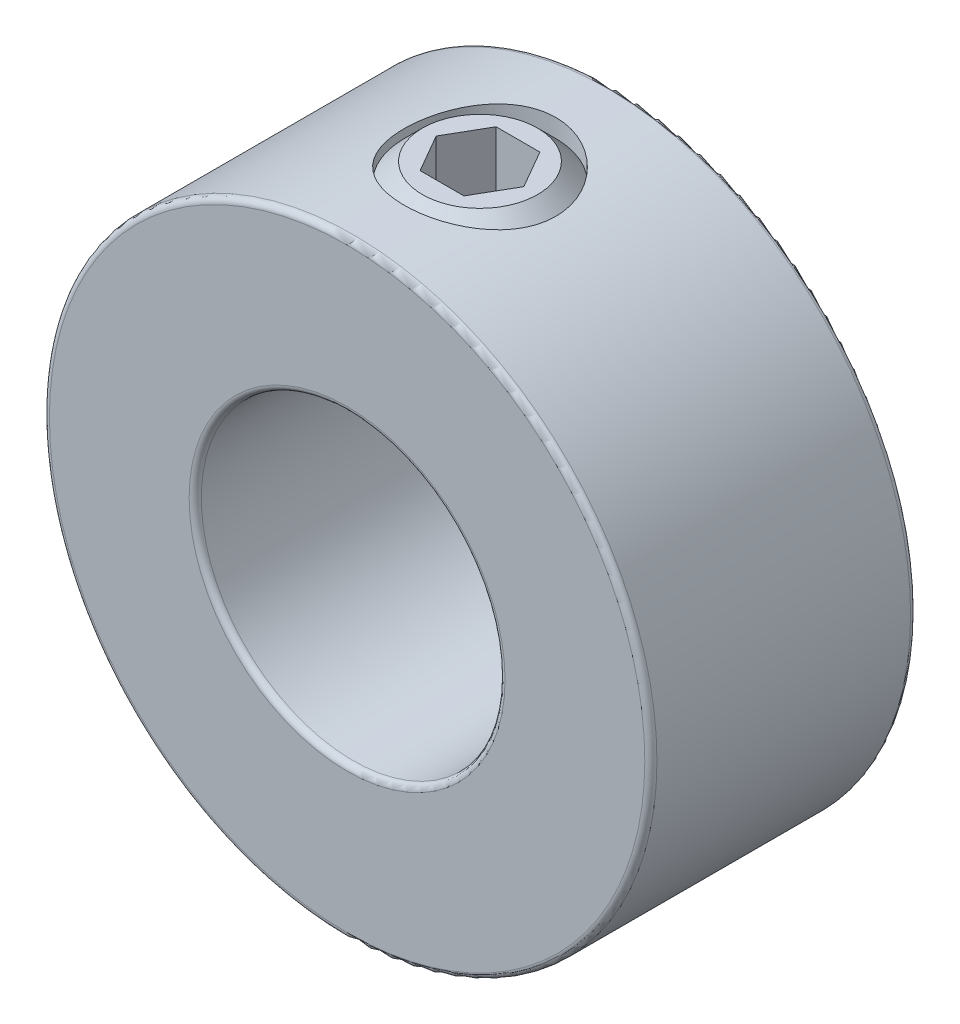
ISO-10303-21;
HEADER;
FILE_DESCRIPTION(('STEP AP214'),'2;1');
FILE_NAME('part.step','',(''),(''),'','','');
FILE_SCHEMA(('AUTOMOTIVE_DESIGN { 1 0 10303 214 1 1 1 1 }'));
ENDSEC;
DATA;
#1=APPLICATION_CONTEXT('core data for automotive mechanical design processes');
#2=APPLICATION_PROTOCOL_DEFINITION('international standard','automotive_design',2000,#1);
#3=PRODUCT_CONTEXT('',#1,'mechanical');
#4=PRODUCT('Part','Part','',(#3));
#5=PRODUCT_RELATED_PRODUCT_CATEGORY('part','',(#4));
#6=PRODUCT_DEFINITION_FORMATION('','',#4);
#7=PRODUCT_DEFINITION_CONTEXT('part definition',#1,'design');
#8=PRODUCT_DEFINITION('design','',#6,#7);
#9=PRODUCT_DEFINITION_SHAPE('','',#8);
#10=(LENGTH_UNIT() NAMED_UNIT(*) SI_UNIT(.MILLI.,.METRE.));
#11=(NAMED_UNIT(*) PLANE_ANGLE_UNIT() SI_UNIT($,.RADIAN.));
#12=(NAMED_UNIT(*) SI_UNIT($,.STERADIAN.) SOLID_ANGLE_UNIT());
#13=UNCERTAINTY_MEASURE_WITH_UNIT(LENGTH_MEASURE(1.E-05),#10,'distance_accuracy_value','');
#14=(GEOMETRIC_REPRESENTATION_CONTEXT(3) GLOBAL_UNCERTAINTY_ASSIGNED_CONTEXT((#13)) GLOBAL_UNIT_ASSIGNED_CONTEXT((#10,
#11,#12)) REPRESENTATION_CONTEXT('',''));
#15=CARTESIAN_POINT('',(0.,0.,0.));
#16=DIRECTION('',(0.,0.,1.));
#17=DIRECTION('',(1.,0.,0.));
#18=AXIS2_PLACEMENT_3D('',#15,#16,#17);
#19=CARTESIAN_POINT('',(0.,12.7,0.));
#20=DIRECTION('',(0.,1.,0.));
#21=DIRECTION('',(-1.,0.,0.));
#22=AXIS2_PLACEMENT_3D('',#19,#20,#21);
#23=PLANE('',#22);
#24=CARTESIAN_POINT('',(0.,12.7,0.));
#25=DIRECTION('',(0.,1.,0.));
#26=DIRECTION('',(-1.,0.,0.));
#27=AXIS2_PLACEMENT_3D('',#24,#25,#26);
#28=CIRCLE('',#27,2.40819263124403);
#29=CARTESIAN_POINT('',(-2.40819263124403,12.7,0.));
#30=VERTEX_POINT('',#29);
#31=EDGE_CURVE('E116',#30,#30,#28,.T.);
#32=ORIENTED_EDGE('',*,*,#31,.T.);
#33=EDGE_LOOP('',(#32));
#34=FACE_BOUND('',#33,.T.);
#35=DIRECTION('',(1.,0.,0.));
#36=VECTOR('',#35,1.);
#37=CARTESIAN_POINT('',(-0.916543552338531,12.7,-1.5875));
#38=LINE('',#37,#36);
#39=CARTESIAN_POINT('',(-0.916543552338531,12.7,-1.5875));
#40=VERTEX_POINT('',#39);
#41=CARTESIAN_POINT('',(0.91654355233853,12.7,-1.5875));
#42=VERTEX_POINT('',#41);
#43=EDGE_CURVE('E111',#40,#42,#38,.T.);
#44=ORIENTED_EDGE('',*,*,#43,.T.);
#45=DIRECTION('',(0.5,0.,0.866025403784439));
#46=VECTOR('',#45,1.);
#47=CARTESIAN_POINT('',(0.91654355233853,12.7,-1.5875));
#48=LINE('',#47,#46);
#49=CARTESIAN_POINT('',(1.83308710467706,12.7,0.));
#50=VERTEX_POINT('',#49);
#51=EDGE_CURVE('E57',#42,#50,#48,.T.);
#52=ORIENTED_EDGE('',*,*,#51,.T.);
#53=DIRECTION('',(-0.5,0.,0.866025403784439));
#54=VECTOR('',#53,1.);
#55=CARTESIAN_POINT('',(1.83308710467706,12.7,0.));
#56=LINE('',#55,#54);
#57=CARTESIAN_POINT('',(0.916543552338532,12.7,1.5875));
#58=VERTEX_POINT('',#57);
#59=EDGE_CURVE('E115',#50,#58,#56,.T.);
#60=ORIENTED_EDGE('',*,*,#59,.T.);
#61=DIRECTION('',(-1.,0.,0.));
#62=VECTOR('',#61,1.);
#63=CARTESIAN_POINT('',(0.916543552338532,12.7,1.5875));
#64=LINE('',#63,#62);
#65=CARTESIAN_POINT('',(-0.916543552338531,12.7,1.5875));
#66=VERTEX_POINT('',#65);
#67=EDGE_CURVE('E273',#58,#66,#64,.T.);
#68=ORIENTED_EDGE('',*,*,#67,.T.);
#69=DIRECTION('',(-0.5,0.,-0.866025403784438));
#70=VECTOR('',#69,1.);
#71=CARTESIAN_POINT('',(-0.916543552338531,12.7,1.5875));
#72=LINE('',#71,#70);
#73=CARTESIAN_POINT('',(-1.83308710467706,12.7,0.));
#74=VERTEX_POINT('',#73);
#75=EDGE_CURVE('E270',#66,#74,#72,.T.);
#76=ORIENTED_EDGE('',*,*,#75,.T.);
#77=DIRECTION('',(0.5,0.,-0.866025403784438));
#78=VECTOR('',#77,1.);
#79=CARTESIAN_POINT('',(-1.83308710467706,12.7,0.));
#80=LINE('',#79,#78);
#81=EDGE_CURVE('E264',#74,#40,#80,.T.);
#82=ORIENTED_EDGE('',*,*,#81,.T.);
#83=EDGE_LOOP('',(#44,#52,#60,#68,#76,#82));
#84=FACE_BOUND('',#83,.T.);
#85=ADVANCED_FACE('F42',(#34,#84),#23,.T.);
#86=CARTESIAN_POINT('',(0.,6.35,0.));
#87=DIRECTION('',(0.,-1.,0.));
#88=DIRECTION('',(1.,0.,0.));
#89=AXIS2_PLACEMENT_3D('',#86,#87,#88);
#90=CONICAL_SURFACE('',#89,0.920168842507158,0.785398163397448);
#91=CARTESIAN_POINT('',(0.,7.27016884250716,0.));
#92=VERTEX_POINT('',#91);
#93=VERTEX_LOOP('',#92);
#94=FACE_BOUND('',#93,.T.);
#95=CARTESIAN_POINT('',(0.,6.35,0.));
#96=DIRECTION('',(0.,1.,0.));
#97=DIRECTION('',(-1.,0.,0.));
#98=AXIS2_PLACEMENT_3D('',#95,#96,#97);
#99=CIRCLE('',#98,0.920168842507158);
#100=CARTESIAN_POINT('',(-0.920168842507158,6.35,0.));
#101=VERTEX_POINT('',#100);
#102=EDGE_CURVE('E12',#101,#101,#99,.T.);
#103=ORIENTED_EDGE('',*,*,#102,.F.);
#104=EDGE_LOOP('',(#103));
#105=FACE_BOUND('',#104,.T.);
#106=ADVANCED_FACE('F44',(#94,#105),#90,.F.);
#107=CARTESIAN_POINT('',(-2.40819263124403,6.35,0.));
#108=DIRECTION('',(0.,-1.,0.));
#109=DIRECTION('',(1.,0.,0.));
#110=AXIS2_PLACEMENT_3D('',#107,#108,#109);
#111=PLANE('',#110);
#112=ORIENTED_EDGE('',*,*,#102,.T.);
#113=EDGE_LOOP('',(#112));
#114=FACE_BOUND('',#113,.T.);
#115=CARTESIAN_POINT('',(0.,6.35,0.));
#116=DIRECTION('',(0.,1.,0.));
#117=DIRECTION('',(-1.,0.,0.));
#118=AXIS2_PLACEMENT_3D('',#115,#116,#117);
#119=CIRCLE('',#118,2.40819263124403);
#120=CARTESIAN_POINT('',(-2.40819263124403,6.35,0.));
#121=VERTEX_POINT('',#120);
#122=EDGE_CURVE('E50',#121,#121,#119,.T.);
#123=ORIENTED_EDGE('',*,*,#122,.F.);
#124=EDGE_LOOP('',(#123));
#125=FACE_BOUND('',#124,.T.);
#126=ADVANCED_FACE('F136',(#114,#125),#111,.T.);
#127=CARTESIAN_POINT('',(0.,7.11680736875596,0.));
#128=DIRECTION('',(0.,1.,0.));
#129=DIRECTION('',(-1.,0.,0.));
#130=AXIS2_PLACEMENT_3D('',#127,#128,#129);
#131=CONICAL_SURFACE('',#130,3.175,0.785398163397448);
#132=ORIENTED_EDGE('',*,*,#122,.T.);
#133=EDGE_LOOP('',(#132));
#134=FACE_BOUND('',#133,.T.);
#135=CARTESIAN_POINT('',(0.,7.11680736875596,0.));
#136=DIRECTION('',(0.,1.,0.));
#137=DIRECTION('',(-1.,0.,0.));
#138=AXIS2_PLACEMENT_3D('',#135,#136,#137);
#139=CIRCLE('',#138,3.175);
#140=CARTESIAN_POINT('',(-3.175,7.11680736875596,0.));
#141=VERTEX_POINT('',#140);
#142=EDGE_CURVE('E128',#141,#141,#139,.T.);
#143=ORIENTED_EDGE('',*,*,#142,.F.);
#144=EDGE_LOOP('',(#143));
#145=FACE_BOUND('',#144,.T.);
#146=ADVANCED_FACE('F133',(#134,#145),#131,.T.);
#147=CARTESIAN_POINT('',(0.,6.35,0.));
#148=DIRECTION('',(0.,1.,0.));
#149=DIRECTION('',(-1.,0.,0.));
#150=AXIS2_PLACEMENT_3D('',#147,#148,#149);
#151=CYLINDRICAL_SURFACE('',#150,3.175);
#152=ORIENTED_EDGE('',*,*,#142,.T.);
#153=EDGE_LOOP('',(#152));
#154=FACE_BOUND('',#153,.T.);
#155=CARTESIAN_POINT('',(0.,11.933192631244,0.));
#156=DIRECTION('',(0.,1.,0.));
#157=DIRECTION('',(-1.,0.,0.));
#158=AXIS2_PLACEMENT_3D('',#155,#156,#157);
#159=CIRCLE('',#158,3.175);
#160=CARTESIAN_POINT('',(-3.175,11.933192631244,0.));
#161=VERTEX_POINT('',#160);
#162=EDGE_CURVE('E120',#161,#161,#159,.T.);
#163=ORIENTED_EDGE('',*,*,#162,.F.);
#164=EDGE_LOOP('',(#163));
#165=FACE_BOUND('',#164,.T.);
#166=ADVANCED_FACE('F143',(#154,#165),#151,.T.);
#167=CARTESIAN_POINT('',(0.,12.7,0.));
#168=DIRECTION('',(0.,-1.,0.));
#169=DIRECTION('',(1.,0.,0.));
#170=AXIS2_PLACEMENT_3D('',#167,#168,#169);
#171=CONICAL_SURFACE('',#170,2.40819263124403,0.785398163397448);
#172=ORIENTED_EDGE('',*,*,#162,.T.);
#173=EDGE_LOOP('',(#172));
#174=FACE_BOUND('',#173,.T.);
#175=ORIENTED_EDGE('',*,*,#31,.F.);
#176=EDGE_LOOP('',(#175));
#177=FACE_BOUND('',#176,.T.);
#178=ADVANCED_FACE('F154',(#174,#177),#171,.T.);
#179=CARTESIAN_POINT('',(0.91654355233853,9.52499999999999,-1.5875));
#180=DIRECTION('',(-0.866025403784439,0.,0.5));
#181=DIRECTION('',(0.5,0.,0.866025403784439));
#182=AXIS2_PLACEMENT_3D('',#179,#180,#181);
#183=PLANE('',#182);
#184=ORIENTED_EDGE('',*,*,#51,.F.);
#185=DIRECTION('',(0.,1.,0.));
#186=VECTOR('',#185,1.);
#187=CARTESIAN_POINT('',(0.91654355233853,9.52499999999999,-1.5875));
#188=LINE('',#187,#186);
#189=CARTESIAN_POINT('',(0.91654355233853,9.52499999999999,-1.5875));
#190=VERTEX_POINT('',#189);
#191=EDGE_CURVE('E110',#190,#42,#188,.T.);
#192=ORIENTED_EDGE('',*,*,#191,.F.);
#193=DIRECTION('',(0.5,0.,0.866025403784439));
#194=VECTOR('',#193,1.);
#195=CARTESIAN_POINT('',(0.91654355233853,9.52499999999999,-1.5875));
#196=LINE('',#195,#194);
#197=CARTESIAN_POINT('',(1.83308710467706,9.52499999999999,0.));
#198=VERTEX_POINT('',#197);
#199=EDGE_CURVE('E101',#190,#198,#196,.T.);
#200=ORIENTED_EDGE('',*,*,#199,.T.);
#201=DIRECTION('',(0.,1.,0.));
#202=VECTOR('',#201,1.);
#203=CARTESIAN_POINT('',(1.83308710467706,9.52499999999999,0.));
#204=LINE('',#203,#202);
#205=EDGE_CURVE('E109',#198,#50,#204,.T.);
#206=ORIENTED_EDGE('',*,*,#205,.T.);
#207=EDGE_LOOP('',(#184,#192,#200,#206));
#208=FACE_BOUND('',#207,.T.);
#209=ADVANCED_FACE('F108',(#208),#183,.T.);
#210=CARTESIAN_POINT('',(1.83308710467706,9.52499999999999,0.));
#211=DIRECTION('',(-0.866025403784439,0.,-0.5));
#212=DIRECTION('',(-0.5,0.,0.866025403784439));
#213=AXIS2_PLACEMENT_3D('',#210,#211,#212);
#214=PLANE('',#213);
#215=ORIENTED_EDGE('',*,*,#59,.F.);
#216=ORIENTED_EDGE('',*,*,#205,.F.);
#217=DIRECTION('',(-0.5,0.,0.866025403784439));
#218=VECTOR('',#217,1.);
#219=CARTESIAN_POINT('',(1.83308710467706,9.52499999999999,0.));
#220=LINE('',#219,#218);
#221=CARTESIAN_POINT('',(0.916543552338532,9.52499999999999,1.5875));
#222=VERTEX_POINT('',#221);
#223=EDGE_CURVE('E97',#198,#222,#220,.T.);
#224=ORIENTED_EDGE('',*,*,#223,.T.);
#225=DIRECTION('',(0.,1.,0.));
#226=VECTOR('',#225,1.);
#227=CARTESIAN_POINT('',(0.916543552338532,9.52499999999999,1.5875));
#228=LINE('',#227,#226);
#229=EDGE_CURVE('E117',#222,#58,#228,.T.);
#230=ORIENTED_EDGE('',*,*,#229,.T.);
#231=EDGE_LOOP('',(#215,#216,#224,#230));
#232=FACE_BOUND('',#231,.T.);
#233=ADVANCED_FACE('F113',(#232),#214,.T.);
#234=CARTESIAN_POINT('',(0.916543552338532,9.52499999999999,1.5875));
#235=DIRECTION('',(0.,0.,-1.));
#236=DIRECTION('',(-1.,0.,0.));
#237=AXIS2_PLACEMENT_3D('',#234,#235,#236);
#238=PLANE('',#237);
#239=ORIENTED_EDGE('',*,*,#67,.F.);
#240=ORIENTED_EDGE('',*,*,#229,.F.);
#241=DIRECTION('',(-1.,0.,0.));
#242=VECTOR('',#241,1.);
#243=CARTESIAN_POINT('',(0.916543552338532,9.52499999999999,1.5875));
#244=LINE('',#243,#242);
#245=CARTESIAN_POINT('',(-0.916543552338531,9.52499999999999,1.5875));
#246=VERTEX_POINT('',#245);
#247=EDGE_CURVE('E103',#222,#246,#244,.T.);
#248=ORIENTED_EDGE('',*,*,#247,.T.);
#249=DIRECTION('',(0.,1.,0.));
#250=VECTOR('',#249,1.);
#251=CARTESIAN_POINT('',(-0.916543552338531,9.52499999999999,1.5875));
#252=LINE('',#251,#250);
#253=EDGE_CURVE('E122',#246,#66,#252,.T.);
#254=ORIENTED_EDGE('',*,*,#253,.T.);
#255=EDGE_LOOP('',(#239,#240,#248,#254));
#256=FACE_BOUND('',#255,.T.);
#257=ADVANCED_FACE('F184',(#256),#238,.T.);
#258=CARTESIAN_POINT('',(-0.916543552338531,9.52499999999999,1.5875));
#259=DIRECTION('',(0.866025403784439,0.,-0.5));
#260=DIRECTION('',(-0.5,0.,-0.866025403784439));
#261=AXIS2_PLACEMENT_3D('',#258,#259,#260);
#262=PLANE('',#261);
#263=ORIENTED_EDGE('',*,*,#75,.F.);
#264=ORIENTED_EDGE('',*,*,#253,.F.);
#265=DIRECTION('',(-0.5,0.,-0.866025403784438));
#266=VECTOR('',#265,1.);
#267=CARTESIAN_POINT('',(-0.916543552338531,9.52499999999999,1.5875));
#268=LINE('',#267,#266);
#269=CARTESIAN_POINT('',(-1.83308710467706,9.52499999999999,0.));
#270=VERTEX_POINT('',#269);
#271=EDGE_CURVE('E289',#246,#270,#268,.T.);
#272=ORIENTED_EDGE('',*,*,#271,.T.);
#273=DIRECTION('',(0.,1.,0.));
#274=VECTOR('',#273,1.);
#275=CARTESIAN_POINT('',(-1.83308710467706,9.52499999999999,0.));
#276=LINE('',#275,#274);
#277=EDGE_CURVE('E280',#270,#74,#276,.T.);
#278=ORIENTED_EDGE('',*,*,#277,.T.);
#279=EDGE_LOOP('',(#263,#264,#272,#278));
#280=FACE_BOUND('',#279,.T.);
#281=ADVANCED_FACE('F190',(#280),#262,.T.);
#282=CARTESIAN_POINT('',(-1.83308710467706,9.52499999999999,0.));
#283=DIRECTION('',(0.866025403784439,0.,0.5));
#284=DIRECTION('',(0.5,0.,-0.866025403784439));
#285=AXIS2_PLACEMENT_3D('',#282,#283,#284);
#286=PLANE('',#285);
#287=ORIENTED_EDGE('',*,*,#81,.F.);
#288=ORIENTED_EDGE('',*,*,#277,.F.);
#289=DIRECTION('',(0.5,0.,-0.866025403784438));
#290=VECTOR('',#289,1.);
#291=CARTESIAN_POINT('',(-1.83308710467706,9.52499999999999,0.));
#292=LINE('',#291,#290);
#293=CARTESIAN_POINT('',(-0.916543552338531,9.52499999999999,-1.5875));
#294=VERTEX_POINT('',#293);
#295=EDGE_CURVE('E287',#270,#294,#292,.T.);
#296=ORIENTED_EDGE('',*,*,#295,.T.);
#297=DIRECTION('',(0.,1.,0.));
#298=VECTOR('',#297,1.);
#299=CARTESIAN_POINT('',(-0.916543552338531,9.52499999999999,-1.5875));
#300=LINE('',#299,#298);
#301=EDGE_CURVE('E263',#294,#40,#300,.T.);
#302=ORIENTED_EDGE('',*,*,#301,.T.);
#303=EDGE_LOOP('',(#287,#288,#296,#302));
#304=FACE_BOUND('',#303,.T.);
#305=ADVANCED_FACE('F198',(#304),#286,.T.);
#306=CARTESIAN_POINT('',(-0.916543552338531,9.52499999999999,-1.5875));
#307=DIRECTION('',(0.,0.,1.));
#308=DIRECTION('',(1.,0.,0.));
#309=AXIS2_PLACEMENT_3D('',#306,#307,#308);
#310=PLANE('',#309);
#311=ORIENTED_EDGE('',*,*,#43,.F.);
#312=ORIENTED_EDGE('',*,*,#301,.F.);
#313=DIRECTION('',(1.,0.,0.));
#314=VECTOR('',#313,1.);
#315=CARTESIAN_POINT('',(-0.916543552338531,9.52499999999999,-1.5875));
#316=LINE('',#315,#314);
#317=EDGE_CURVE('E278',#294,#190,#316,.T.);
#318=ORIENTED_EDGE('',*,*,#317,.T.);
#319=ORIENTED_EDGE('',*,*,#191,.T.);
#320=EDGE_LOOP('',(#311,#312,#318,#319));
#321=FACE_BOUND('',#320,.T.);
#322=ADVANCED_FACE('F206',(#321),#310,.T.);
#323=CARTESIAN_POINT('',(0.,9.52499999999999,-3.175));
#324=DIRECTION('',(0.,1.,0.));
#325=DIRECTION('',(0.,0.,1.));
#326=AXIS2_PLACEMENT_3D('',#323,#324,#325);
#327=PLANE('',#326);
#328=ORIENTED_EDGE('',*,*,#199,.F.);
#329=ORIENTED_EDGE('',*,*,#317,.F.);
#330=ORIENTED_EDGE('',*,*,#295,.F.);
#331=ORIENTED_EDGE('',*,*,#271,.F.);
#332=ORIENTED_EDGE('',*,*,#247,.F.);
#333=ORIENTED_EDGE('',*,*,#223,.F.);
#334=EDGE_LOOP('',(#328,#329,#330,#331,#332,#333));
#335=FACE_BOUND('',#334,.T.);
#336=ADVANCED_FACE('F99',(#335),#327,.T.);
#337=CLOSED_SHELL('',(#85,#106,#126,#146,#166,#178,#209,#233,#257,#281,#305,#322,#336));
#338=MANIFOLD_SOLID_BREP('B2',#337);
#339=CARTESIAN_POINT('',(0.,0.,5.55625));
#340=DIRECTION('',(0.,0.,1.));
#341=DIRECTION('',(1.,0.,0.));
#342=AXIS2_PLACEMENT_3D('',#339,#340,#341);
#343=PLANE('',#342);
#344=CARTESIAN_POINT('',(0.,0.,5.55625));
#345=DIRECTION('',(0.,0.,1.));
#346=DIRECTION('',(1.,0.,0.));
#347=AXIS2_PLACEMENT_3D('',#344,#345,#346);
#348=CIRCLE('',#347,6.604);
#349=CARTESIAN_POINT('',(6.604,0.,5.55625));
#350=VERTEX_POINT('',#349);
#351=EDGE_CURVE('E307',#350,#350,#348,.F.);
#352=ORIENTED_EDGE('',*,*,#351,.T.);
#353=EDGE_LOOP('',(#352));
#354=FACE_BOUND('',#353,.T.);
#355=CARTESIAN_POINT('',(0.,0.,5.55625));
#356=DIRECTION('',(0.,0.,1.));
#357=DIRECTION('',(1.,0.,0.));
#358=AXIS2_PLACEMENT_3D('',#355,#356,#357);
#359=CIRCLE('',#358,12.446);
#360=CARTESIAN_POINT('',(12.446,0.,5.55625));
#361=VERTEX_POINT('',#360);
#362=EDGE_CURVE('E311',#361,#361,#359,.T.);
#363=ORIENTED_EDGE('',*,*,#362,.T.);
#364=EDGE_LOOP('',(#363));
#365=FACE_BOUND('',#364,.T.);
#366=ADVANCED_FACE('F296',(#354,#365),#343,.T.);
#367=CARTESIAN_POINT('',(0.,0.,-5.55625));
#368=DIRECTION('',(0.,0.,1.));
#369=DIRECTION('',(1.,0.,0.));
#370=AXIS2_PLACEMENT_3D('',#367,#368,#369);
#371=PLANE('',#370);
#372=CARTESIAN_POINT('',(0.,0.,-5.55625));
#373=DIRECTION('',(0.,0.,1.));
#374=DIRECTION('',(1.,0.,0.));
#375=AXIS2_PLACEMENT_3D('',#372,#373,#374);
#376=CIRCLE('',#375,6.604);
#377=CARTESIAN_POINT('',(6.604,0.,-5.55625));
#378=VERTEX_POINT('',#377);
#379=EDGE_CURVE('E322',#378,#378,#376,.T.);
#380=ORIENTED_EDGE('',*,*,#379,.T.);
#381=EDGE_LOOP('',(#380));
#382=FACE_BOUND('',#381,.T.);
#383=CARTESIAN_POINT('',(0.,0.,-5.55625));
#384=DIRECTION('',(0.,0.,1.));
#385=DIRECTION('',(1.,0.,0.));
#386=AXIS2_PLACEMENT_3D('',#383,#384,#385);
#387=CIRCLE('',#386,12.446);
#388=CARTESIAN_POINT('',(12.446,0.,-5.55625));
#389=VERTEX_POINT('',#388);
#390=EDGE_CURVE('E325',#389,#389,#387,.F.);
#391=ORIENTED_EDGE('',*,*,#390,.T.);
#392=EDGE_LOOP('',(#391));
#393=FACE_BOUND('',#392,.T.);
#394=ADVANCED_FACE('F359',(#382,#393),#371,.F.);
#395=CARTESIAN_POINT('',(0.,0.,5.55625));
#396=DIRECTION('',(0.,0.,-1.));
#397=DIRECTION('',(-1.,0.,0.));
#398=AXIS2_PLACEMENT_3D('',#395,#396,#397);
#399=CYLINDRICAL_SURFACE('',#398,12.7);
#400=CARTESIAN_POINT('',(0.,0.,-5.30225));
#401=DIRECTION('',(0.,0.,1.));
#402=DIRECTION('',(1.,0.,0.));
#403=AXIS2_PLACEMENT_3D('',#400,#401,#402);
#404=CIRCLE('',#403,12.7);
#405=CARTESIAN_POINT('',(12.7,0.,-5.30225));
#406=VERTEX_POINT('',#405);
#407=EDGE_CURVE('E41',#406,#406,#404,.T.);
#408=ORIENTED_EDGE('',*,*,#407,.T.);
#409=EDGE_LOOP('',(#408));
#410=FACE_BOUND('',#409,.T.);
#411=CARTESIAN_POINT('',(0.,0.,5.30225));
#412=DIRECTION('',(0.,0.,1.));
#413=DIRECTION('',(1.,0.,0.));
#414=AXIS2_PLACEMENT_3D('',#411,#412,#413);
#415=CIRCLE('',#414,12.7);
#416=CARTESIAN_POINT('',(12.7,0.,5.30225));
#417=VERTEX_POINT('',#416);
#418=EDGE_CURVE('E303',#417,#417,#415,.F.);
#419=ORIENTED_EDGE('',*,*,#418,.T.);
#420=EDGE_LOOP('',(#419));
#421=FACE_BOUND('',#420,.T.);
#422=CARTESIAN_POINT('',(0.,12.7,-3.175));
#423=CARTESIAN_POINT('',(0.175421054350931,12.6999970338729,-3.17499507718756));
#424=CARTESIAN_POINT('',(0.350897100741782,12.6963292371237,-3.16041288419548));
#425=CARTESIAN_POINT('',(0.69682005198096,12.6820530760661,-3.10255676306683));
#426=CARTESIAN_POINT('',(0.867264049209731,12.6714407780562,-3.05926657314488));
#427=CARTESIAN_POINT('',(1.19807751278645,12.6444507573613,-2.94547024683858));
#428=CARTESIAN_POINT('',(1.35845880926017,12.6280799601569,-2.87499679271934));
#429=CARTESIAN_POINT('',(1.6651226791977,12.591316443928,-2.70894939107175));
#430=CARTESIAN_POINT('',(1.81140477687155,12.5709235892463,-2.61337459688152));
#431=CARTESIAN_POINT('',(2.08873074612027,12.5278602543575,-2.39775832856532));
#432=CARTESIAN_POINT('',(2.2194428772959,12.5051546346353,-2.27729716633665));
#433=CARTESIAN_POINT('',(2.45903522924702,12.4602582924963,-2.01622616627587));
#434=CARTESIAN_POINT('',(2.56791298487579,12.4380676284689,-1.87561405642898));
#435=CARTESIAN_POINT('',(2.76230618225783,12.3963594189446,-1.57565677007337));
#436=CARTESIAN_POINT('',(2.84745052370821,12.3768864828385,-1.41606432812152));
#437=CARTESIAN_POINT('',(2.98957345643241,12.343330973648,-1.08426586198626));
#438=CARTESIAN_POINT('',(3.04655655068163,12.3292475388652,-0.912061859447231));
#439=CARTESIAN_POINT('',(3.12960773790342,12.3084267567388,-0.563576262139818));
#440=CARTESIAN_POINT('',(3.15627230130284,12.3015478927701,-0.387445470052915));
#441=CARTESIAN_POINT('',(3.17978742389056,12.2954915053947,-0.0330865289513835));
#442=CARTESIAN_POINT('',(3.176642833515,12.2963127290578,0.145141274131692));
#443=CARTESIAN_POINT('',(3.14110481048737,12.3054365167726,0.494063459727666));
#444=CARTESIAN_POINT('',(3.10942215340351,12.3135572669877,0.664835732101618));
#445=CARTESIAN_POINT('',(3.01884119561133,12.3360753547043,0.998560891095076));
#446=CARTESIAN_POINT('',(2.95994095604688,12.3504731393489,1.16151321974455));
#447=CARTESIAN_POINT('',(2.81599106163371,12.3840899110031,1.47687880106701));
#448=CARTESIAN_POINT('',(2.73068344564301,12.4033560981111,1.62916906362126));
#449=CARTESIAN_POINT('',(2.53652078423164,12.4445122129068,1.91752793565194));
#450=CARTESIAN_POINT('',(2.42766161831204,12.4664025994163,2.05359370007568));
#451=CARTESIAN_POINT('',(2.18580424890858,12.5111061380944,2.30971431988649));
#452=CARTESIAN_POINT('',(2.05220624645107,12.533927803951,2.42920200396319));
#453=CARTESIAN_POINT('',(1.76659522538283,12.5773596047503,2.64418496321526));
#454=CARTESIAN_POINT('',(1.61458164448181,12.5979696721291,2.73967950552455));
#455=CARTESIAN_POINT('',(1.29564529770895,12.6347586626604,2.90417374084162));
#456=CARTESIAN_POINT('',(1.12867311562492,12.6509221227036,2.97308130353854));
#457=CARTESIAN_POINT('',(0.785020883902435,12.676884242985,3.0816916304186));
#458=CARTESIAN_POINT('',(0.608342698201859,12.6866841206814,3.12139998108506));
#459=CARTESIAN_POINT('',(0.255142937325556,12.6986347345774,3.16961851376621));
#460=CARTESIAN_POINT('',(0.078733057308377,12.7009747992585,3.17890107185939));
#461=CARTESIAN_POINT('',(-0.273119584996527,12.6982813685726,3.16812294564922));
#462=CARTESIAN_POINT('',(-0.448562432914396,12.6932485369526,3.14806490274183));
#463=CARTESIAN_POINT('',(-0.790816868910238,12.6764961338622,3.07981157723825));
#464=CARTESIAN_POINT('',(-0.957717835150521,12.6648767569325,3.03203765897374));
#465=CARTESIAN_POINT('',(-1.28112793569116,12.6362609570897,2.91019000547309));
#466=CARTESIAN_POINT('',(-1.43763601861911,12.6192639911647,2.83611361420368));
#467=CARTESIAN_POINT('',(-1.73889063454314,12.5813250177716,2.6622668605486));
#468=CARTESIAN_POINT('',(-1.88337918521903,12.5603183592593,2.56206389542727));
#469=CARTESIAN_POINT('',(-2.15376466554501,12.5167921111412,2.33936135971267));
#470=CARTESIAN_POINT('',(-2.27965837982672,12.4942722608556,2.21685794114268));
#471=CARTESIAN_POINT('',(-2.51246336908675,12.4495762556412,1.94944584954746));
#472=CARTESIAN_POINT('',(-2.6188328531313,12.4274221051899,1.80406102865082));
#473=CARTESIAN_POINT('',(-2.80566443991221,12.3865825924258,1.49704925704163));
#474=CARTESIAN_POINT('',(-2.88612769264178,12.3678970761538,1.335423027713));
#475=CARTESIAN_POINT('',(-3.0182638402854,12.3363163381503,1.00138288757303));
#476=CARTESIAN_POINT('',(-3.07010730622843,12.3233869021911,0.829039853404032));
#477=CARTESIAN_POINT('',(-3.14398164687971,12.3047494152553,0.477711266541238));
#478=CARTESIAN_POINT('',(-3.16601904149253,12.299039785006,0.298727175343936));
#479=CARTESIAN_POINT('',(-3.17931501621074,12.2956087422145,-0.0552895005203962));
#480=CARTESIAN_POINT('',(-3.17143955029538,12.2976625750886,-0.230287904387485));
#481=CARTESIAN_POINT('',(-3.1271152390873,12.3090074061494,-0.576376564376255));
#482=CARTESIAN_POINT('',(-3.09066696801937,12.3182982588945,-0.747466898966899));
#483=CARTESIAN_POINT('',(-2.9907046261569,12.3429450180984,-1.07994123834368));
#484=CARTESIAN_POINT('',(-2.92735297324093,12.3582644892528,-1.24137696275537));
#485=CARTESIAN_POINT('',(-2.7755107337966,12.3932474960913,-1.5514433934137));
#486=CARTESIAN_POINT('',(-2.68701666057215,12.4129116342002,-1.70007231991313));
#487=CARTESIAN_POINT('',(-2.48468673461549,12.4550092586011,-1.98449063138675));
#488=CARTESIAN_POINT('',(-2.37025002816433,12.4775016056118,-2.11984393874715));
#489=CARTESIAN_POINT('',(-2.12045416901821,12.5223699100401,-2.36970791148384));
#490=CARTESIAN_POINT('',(-1.98509005500274,12.5447458385544,-2.48421362040584));
#491=CARTESIAN_POINT('',(-1.6943230585205,12.5873437112106,-2.69115393646168));
#492=CARTESIAN_POINT('',(-1.53860166056969,12.6075193062447,-2.78315126560482));
#493=CARTESIAN_POINT('',(-1.21341315929717,12.6429542453062,-2.93951546322414));
#494=CARTESIAN_POINT('',(-1.04395600927443,12.6582171100619,-3.0039021300394));
#495=CARTESIAN_POINT('',(-0.729001702698682,12.6798505941374,-3.09366037419776));
#496=CARTESIAN_POINT('',(-0.585004695088745,12.6873547169486,-3.12409679779643));
#497=CARTESIAN_POINT('',(-0.294017851418465,12.6974304774096,-3.16476791399977));
#498=CARTESIAN_POINT('',(-0.147028241296871,12.7000024860439,-3.17500412602955));
#499=CARTESIAN_POINT('',(0.,12.7,-3.175));
#500=B_SPLINE_CURVE_WITH_KNOTS('',3,(#422,#423,#424,#425,#426,#427,#428,#429,#430,#431,#432,
#433,#434,#435,#436,#437,#438,#439,#440,#441,#442,#443,#444,#445,#446,#447,#448,#449,#450,#451,
#452,#453,#454,#455,#456,#457,#458,#459,#460,#461,#462,#463,#464,#465,#466,#467,#468,#469,#470,
#471,#472,#473,#474,#475,#476,#477,#478,#479,#480,#481,#482,#483,#484,#485,#486,#487,#488,#489,
#490,#491,#492,#493,#494,#495,#496,#497,#498,#499),.UNSPECIFIED.,.T.,.F.,(4,2,2,2,2,2,2,2,2,2,2,
2,2,2,2,2,2,2,2,2,2,2,2,2,2,2,2,2,2,2,2,2,2,2,2,2,2,2,4),(0.,0.5257243580655,1.05174676993359,
1.57713870983892,2.10254837335841,2.63767221675277,3.17285644277797,3.71599137305291,
4.25903942808496,4.79120824630597,5.3232904734557,5.84247618671883,6.36169889010143,
6.88616284006739,7.41071862276906,7.95023177058119,8.48976139571985,9.0311441807632,
9.57242335981323,10.09985087283,10.6272309069567,11.1467958106174,11.6664131950588,
12.1952509368702,12.7241800170734,13.266092111565,13.8079801469349,14.34660272276,
14.885107458967,15.4081433519175,15.9311687337377,16.4510804786766,16.9710643590661,
17.5046127008447,18.0382877269755,18.5816279265763,19.1245778677202,19.5652441424438,
20.005877269746),.UNSPECIFIED.);
#501=CARTESIAN_POINT('',(0.,12.7,-3.175));
#502=VERTEX_POINT('',#501);
#503=EDGE_CURVE('E328',#502,#502,#500,.T.);
#504=ORIENTED_EDGE('',*,*,#503,.T.);
#505=EDGE_LOOP('',(#504));
#506=FACE_BOUND('',#505,.T.);
#507=ADVANCED_FACE('F355',(#410,#421,#506),#399,.T.);
#508=CARTESIAN_POINT('',(0.,0.,5.55625));
#509=DIRECTION('',(0.,0.,-1.));
#510=DIRECTION('',(-1.,0.,0.));
#511=AXIS2_PLACEMENT_3D('',#508,#509,#510);
#512=CYLINDRICAL_SURFACE('',#511,6.35);
#513=CARTESIAN_POINT('',(0.,0.,-5.30225));
#514=DIRECTION('',(0.,0.,1.));
#515=DIRECTION('',(1.,0.,0.));
#516=AXIS2_PLACEMENT_3D('',#513,#514,#515);
#517=CIRCLE('',#516,6.35);
#518=CARTESIAN_POINT('',(6.35,0.,-5.30225));
#519=VERTEX_POINT('',#518);
#520=EDGE_CURVE('E316',#519,#519,#517,.F.);
#521=ORIENTED_EDGE('',*,*,#520,.T.);
#522=EDGE_LOOP('',(#521));
#523=FACE_BOUND('',#522,.T.);
#524=CARTESIAN_POINT('',(0.,0.,5.30225));
#525=DIRECTION('',(0.,0.,1.));
#526=DIRECTION('',(1.,0.,0.));
#527=AXIS2_PLACEMENT_3D('',#524,#525,#526);
#528=CIRCLE('',#527,6.35);
#529=CARTESIAN_POINT('',(6.35,0.,5.30225));
#530=VERTEX_POINT('',#529);
#531=EDGE_CURVE('E319',#530,#530,#528,.T.);
#532=ORIENTED_EDGE('',*,*,#531,.T.);
#533=EDGE_LOOP('',(#532));
#534=FACE_BOUND('',#533,.T.);
#535=CARTESIAN_POINT('',(0.,6.35,-3.175));
#536=CARTESIAN_POINT('',(0.0834969220594998,6.34999931166444,-3.17499911228237));
#537=CARTESIAN_POINT('',(0.167002655580042,6.34834758911701,-3.17170012555404));
#538=CARTESIAN_POINT('',(0.333378330258781,6.34179105821714,-3.1585541254501));
#539=CARTESIAN_POINT('',(0.416247978955771,6.33688483467113,-3.14870426347422));
#540=CARTESIAN_POINT('',(0.66318203064701,6.31742426748325,-3.10942793495398));
#541=CARTESIAN_POINT('',(0.825450146761554,6.29812827299425,-3.0702749225986));
#542=CARTESIAN_POINT('',(1.13965128900426,6.2489182313574,-2.96800928870585));
#543=CARTESIAN_POINT('',(1.29162180811868,6.21904547786825,-2.90498978075659));
#544=CARTESIAN_POINT('',(1.58264035037879,6.15142812041637,-2.7572639263711));
#545=CARTESIAN_POINT('',(1.72168939123018,6.11368413715877,-2.67255928984904));
#546=CARTESIAN_POINT('',(1.99234108848171,6.03111096182982,-2.47803037026577));
#547=CARTESIAN_POINT('',(2.12298433900091,5.98599127270818,-2.36699642220607));
#548=CARTESIAN_POINT('',(2.36467069069853,5.89470535591056,-2.12560331642721));
#549=CARTESIAN_POINT('',(2.47569885601321,5.84853836069043,-1.99522957023356));
#550=CARTESIAN_POINT('',(2.68368848497886,5.75623634934464,-1.70657905224668));
#551=CARTESIAN_POINT('',(2.77889135161934,5.71038146176788,-1.54692246869841));
#552=CARTESIAN_POINT('',(2.90019349951534,5.64919759286363,-1.29545201282556));
#553=CARTESIAN_POINT('',(2.93705266116891,5.63006420805933,-1.20959993817132));
#554=CARTESIAN_POINT('',(3.00322508739606,5.59504604853268,-1.03441438629357));
#555=CARTESIAN_POINT('',(3.03254280972159,5.57915935583429,-0.945083001819443));
#556=CARTESIAN_POINT('',(3.08174263292982,5.55212611635049,-0.768989448035253));
#557=CARTESIAN_POINT('',(3.10208128111978,5.54075429137746,-0.682389205971432));
#558=CARTESIAN_POINT('',(3.13545600360765,5.52193654886444,-0.507412721005597));
#559=CARTESIAN_POINT('',(3.14849595237257,5.51448854851135,-0.419037446228295));
#560=CARTESIAN_POINT('',(3.1670771305344,5.50383875782919,-0.241293261151379));
#561=CARTESIAN_POINT('',(3.17262287599649,5.50063441026522,-0.151924982012598));
#562=CARTESIAN_POINT('',(3.17614778806993,5.49859788398609,0.026980784178089));
#563=CARTESIAN_POINT('',(3.17412767659872,5.49976528812799,0.116518254271341));
#564=CARTESIAN_POINT('',(3.1581193033026,5.50899190362733,0.362747875724408));
#565=CARTESIAN_POINT('',(3.13621253452965,5.52160857357707,0.518841729813368));
#566=CARTESIAN_POINT('',(3.07003746372168,5.55866493052824,0.824646641306534));
#567=CARTESIAN_POINT('',(3.02576203854504,5.58310838358077,0.974355649022768));
#568=CARTESIAN_POINT('',(2.91531509833647,5.64157885407237,1.26754429656415));
#569=CARTESIAN_POINT('',(2.84865758129417,5.67581583876129,1.41079760993663));
#570=CARTESIAN_POINT('',(2.69570761526054,5.75003268807633,1.68476608617402));
#571=CARTESIAN_POINT('',(2.60940634674629,5.79001512927804,1.81547557960851));
#572=CARTESIAN_POINT('',(2.40685964249565,5.87734289018611,2.0781042742503));
#573=CARTESIAN_POINT('',(2.28820488335253,5.92497898403936,2.20807538485651));
#574=CARTESIAN_POINT('',(2.03058898448427,6.01813700574905,2.44708514286385));
#575=CARTESIAN_POINT('',(1.89161819563546,6.06365791538158,2.5561137863587));
#576=CARTESIAN_POINT('',(1.58913989972482,6.1500381059768,2.75490191971972));
#577=CARTESIAN_POINT('',(1.42479265164788,6.19058274974572,2.84353148557995));
#578=CARTESIAN_POINT('',(1.08098023585583,6.25976272299952,2.99115808163535));
#579=CARTESIAN_POINT('',(0.901527205073894,6.28840750578946,3.05017864113171));
#580=CARTESIAN_POINT('',(0.548533610626832,6.32854759690358,3.13205940339905));
#581=CARTESIAN_POINT('',(0.375734359385243,6.34126679122995,3.15750967258734));
#582=CARTESIAN_POINT('',(0.0278752299448304,6.35231817716325,3.17965052226026));
#583=CARTESIAN_POINT('',(-0.14718353806002,6.35065718436129,3.17635472713933));
#584=CARTESIAN_POINT('',(-0.480164686080363,6.33384535408399,3.14259376405461));
#585=CARTESIAN_POINT('',(-0.638363620564191,6.31975005060431,3.11425420852516));
#586=CARTESIAN_POINT('',(-0.947441883053002,6.28085393924121,3.03454412179011));
#587=CARTESIAN_POINT('',(-1.09832040207141,6.25605195113515,2.98317105152272));
#588=CARTESIAN_POINT('',(-1.39347133182512,6.19709998236334,2.8575048690622));
#589=CARTESIAN_POINT('',(-1.53743151047822,6.16270299610717,2.78259841588881));
#590=CARTESIAN_POINT('',(-1.8112148234104,6.08787118465664,2.61268357431413));
#591=CARTESIAN_POINT('',(-1.94103189959928,6.0474337895468,2.5176666226146));
#592=CARTESIAN_POINT('',(-2.19636241342679,5.95973602709938,2.29946064962623));
#593=CARTESIAN_POINT('',(-2.3202013468198,5.91219559251098,2.17442139288844));
#594=CARTESIAN_POINT('',(-2.54589381918874,5.81858093231368,1.90523764485025));
#595=CARTESIAN_POINT('',(-2.6477321493525,5.77250773963547,1.76108004761907));
#596=CARTESIAN_POINT('',(-2.83117262876716,5.68487535288742,1.44893139804165));
#597=CARTESIAN_POINT('',(-2.91155594998014,5.64364281441821,1.28012423048962));
#598=CARTESIAN_POINT('',(-3.04191297152938,5.5744767953732,0.928655535110328));
#599=CARTESIAN_POINT('',(-3.0919258549222,5.54652618900869,0.746012202152618));
#600=CARTESIAN_POINT('',(-3.15551086037918,5.51057765714603,0.390810043529834));
#601=CARTESIAN_POINT('',(-3.17212027309711,5.50092192343245,0.218966249592787));
#602=CARTESIAN_POINT('',(-3.17718805563876,5.49800001145358,-0.125244442495205));
#603=CARTESIAN_POINT('',(-3.16565862768385,5.50472672904441,-0.297611081542638));
#604=CARTESIAN_POINT('',(-3.11761548073658,5.53205211477784,-0.620660103073908));
#605=CARTESIAN_POINT('',(-3.08358651207686,5.5512682307627,-0.771843941731147));
#606=CARTESIAN_POINT('',(-2.99458164828807,5.59977978302582,-1.06619083016717));
#607=CARTESIAN_POINT('',(-2.93959901505999,5.62907846127335,-1.2093512828503));
#608=CARTESIAN_POINT('',(-2.8061154442137,5.69685576337174,-1.49423369942854));
#609=CARTESIAN_POINT('',(-2.72628260503929,5.73581889480533,-1.63521280936567));
#610=CARTESIAN_POINT('',(-2.54682759156583,5.81772207082382,-1.9026974317231));
#611=CARTESIAN_POINT('',(-2.44719512169931,5.8606641782013,-2.02919535994271));
#612=CARTESIAN_POINT('',(-2.21680287661218,5.95192753761204,-2.28009752417706));
#613=CARTESIAN_POINT('',(-2.08373188558712,6.00026839877347,-2.40237975641279));
#614=CARTESIAN_POINT('',(-1.79751265125243,6.0921234557675,-2.62339787323311));
#615=CARTESIAN_POINT('',(-1.64435365457427,6.13563504323043,-2.72212106598272));
#616=CARTESIAN_POINT('',(-1.40178715704487,6.19391073190243,-2.85028026619707));
#617=CARTESIAN_POINT('',(-1.31842200030918,6.21223173271383,-2.88980058368139));
#618=CARTESIAN_POINT('',(-1.1480770102167,6.24595363475604,-2.9615994748237));
#619=CARTESIAN_POINT('',(-1.06109897786306,6.26135597012704,-2.99388160653437));
#620=CARTESIAN_POINT('',(-0.884361322813102,6.28875097111981,-3.050759345915));
#621=CARTESIAN_POINT('',(-0.794608244970565,6.30075106809478,-3.07537171813811));
#622=CARTESIAN_POINT('',(-0.612925661591577,6.32100983571903,-3.11666738952989));
#623=CARTESIAN_POINT('',(-0.520997521680286,6.3292707916836,-3.13335553219354));
#624=CARTESIAN_POINT('',(-0.357531347524372,6.34032503263334,-3.15561628486238));
#625=CARTESIAN_POINT('',(-0.286274046488593,6.34394670812889,-3.16287882124963));
#626=CARTESIAN_POINT('',(-0.143346668941345,6.34878452045567,-3.17257112653757));
#627=CARTESIAN_POINT('',(-0.0716765810914251,6.35000059089052,-3.17500076204682));
#628=CARTESIAN_POINT('',(0.,6.35,-3.175));
#629=B_SPLINE_CURVE_WITH_KNOTS('',3,(#535,#536,#537,#538,#539,#540,#541,#542,#543,#544,#545,
#546,#547,#548,#549,#550,#551,#552,#553,#554,#555,#556,#557,#558,#559,#560,#561,#562,#563,#564,
#565,#566,#567,#568,#569,#570,#571,#572,#573,#574,#575,#576,#577,#578,#579,#580,#581,#582,#583,
#584,#585,#586,#587,#588,#589,#590,#591,#592,#593,#594,#595,#596,#597,#598,#599,#600,#601,#602,
#603,#604,#605,#606,#607,#608,#609,#610,#611,#612,#613,#614,#615,#616,#617,#618,#619,#620,#621,
#622,#623,#624,#625,#626,#627,#628),.UNSPECIFIED.,.T.,.F.,(4,2,2,2,2,2,2,2,2,2,2,2,2,2,2,2,2,2,
2,2,2,2,2,2,2,2,2,2,2,2,2,2,2,2,2,2,2,2,2,2,2,2,2,2,2,2,4),(0.,0.25041561210268,
0.500940186864014,1.00234854488129,1.50182051324263,2.00125310940106,2.53090025348452,
3.06094897410615,3.63210298373098,3.91787290005988,4.20347350732849,4.47213270490102,
4.74064915090148,5.00900371453887,5.27733267302576,5.74927594687739,6.22136960256846,
6.70445970327764,7.18776712794021,7.73235646527881,8.27720530143646,8.84735553323666,
9.41705196489304,9.93956405039339,10.4618285011675,10.9436138594975,11.4254523397102,
11.9210677568139,12.4168946391879,12.9614122158798,13.5063050164601,14.0775857365549,
14.6481278321882,15.1639000911419,15.6794487286237,16.1458838633213,16.6124691169503,
17.1104020806943,17.6085946442304,18.1673210354482,18.7263477502426,19.0082017078365,
19.2899168101042,19.5710117490933,19.8519346536844,20.0668939492148,20.2818591776892),.UNSPECIFIED.);
#630=CARTESIAN_POINT('',(0.,6.35,-3.175));
#631=VERTEX_POINT('',#630);
#632=EDGE_CURVE('E329',#631,#631,#629,.T.);
#633=ORIENTED_EDGE('',*,*,#632,.F.);
#634=EDGE_LOOP('',(#633));
#635=FACE_BOUND('',#634,.T.);
#636=ADVANCED_FACE('F339',(#523,#534,#635),#512,.F.);
#637=CARTESIAN_POINT('',(0.,12.7,0.));
#638=DIRECTION('',(0.,-1.,0.));
#639=DIRECTION('',(0.,0.,-1.));
#640=AXIS2_PLACEMENT_3D('',#637,#638,#639);
#641=CYLINDRICAL_SURFACE('',#640,3.175);
#642=ORIENTED_EDGE('',*,*,#632,.T.);
#643=EDGE_LOOP('',(#642));
#644=FACE_BOUND('',#643,.T.);
#645=ORIENTED_EDGE('',*,*,#503,.F.);
#646=EDGE_LOOP('',(#645));
#647=FACE_BOUND('',#646,.T.);
#648=ADVANCED_FACE('F342',(#644,#647),#641,.F.);
#649=CARTESIAN_POINT('',(0.,0.,-5.30225));
#650=DIRECTION('',(0.,0.,1.));
#651=DIRECTION('',(1.,0.,0.));
#652=AXIS2_PLACEMENT_3D('',#649,#650,#651);
#653=TOROIDAL_SURFACE('',#652,6.604,0.254);
#654=ORIENTED_EDGE('',*,*,#520,.F.);
#655=EDGE_LOOP('',(#654));
#656=FACE_BOUND('',#655,.T.);
#657=ORIENTED_EDGE('',*,*,#379,.F.);
#658=EDGE_LOOP('',(#657));
#659=FACE_BOUND('',#658,.T.);
#660=ADVANCED_FACE('F345',(#656,#659),#653,.T.);
#661=CARTESIAN_POINT('',(0.,0.,5.30225));
#662=DIRECTION('',(0.,0.,1.));
#663=DIRECTION('',(1.,0.,0.));
#664=AXIS2_PLACEMENT_3D('',#661,#662,#663);
#665=TOROIDAL_SURFACE('',#664,6.604,0.254);
#666=ORIENTED_EDGE('',*,*,#351,.F.);
#667=EDGE_LOOP('',(#666));
#668=FACE_BOUND('',#667,.T.);
#669=ORIENTED_EDGE('',*,*,#531,.F.);
#670=EDGE_LOOP('',(#669));
#671=FACE_BOUND('',#670,.T.);
#672=ADVANCED_FACE('F352',(#668,#671),#665,.T.);
#673=CARTESIAN_POINT('',(0.,0.,-5.30225));
#674=DIRECTION('',(0.,0.,1.));
#675=DIRECTION('',(1.,0.,0.));
#676=AXIS2_PLACEMENT_3D('',#673,#674,#675);
#677=TOROIDAL_SURFACE('',#676,12.446,0.254);
#678=ORIENTED_EDGE('',*,*,#390,.F.);
#679=EDGE_LOOP('',(#678));
#680=FACE_BOUND('',#679,.T.);
#681=ORIENTED_EDGE('',*,*,#407,.F.);
#682=EDGE_LOOP('',(#681));
#683=FACE_BOUND('',#682,.T.);
#684=ADVANCED_FACE('F371',(#680,#683),#677,.T.);
#685=CARTESIAN_POINT('',(0.,0.,5.30225));
#686=DIRECTION('',(0.,0.,1.));
#687=DIRECTION('',(1.,0.,0.));
#688=AXIS2_PLACEMENT_3D('',#685,#686,#687);
#689=TOROIDAL_SURFACE('',#688,12.446,0.254);
#690=ORIENTED_EDGE('',*,*,#418,.F.);
#691=EDGE_LOOP('',(#690));
#692=FACE_BOUND('',#691,.T.);
#693=ORIENTED_EDGE('',*,*,#362,.F.);
#694=EDGE_LOOP('',(#693));
#695=FACE_BOUND('',#694,.T.);
#696=ADVANCED_FACE('F298',(#692,#695),#689,.T.);
#697=CLOSED_SHELL('',(#366,#394,#507,#636,#648,#660,#672,#684,#696));
#698=MANIFOLD_SOLID_BREP('B6',#697);
#699=ADVANCED_BREP_SHAPE_REPRESENTATION('',(#18,#338,#698),#14);
#700=SHAPE_DEFINITION_REPRESENTATION(#9,#699);
ENDSEC;
END-ISO-10303-21;
